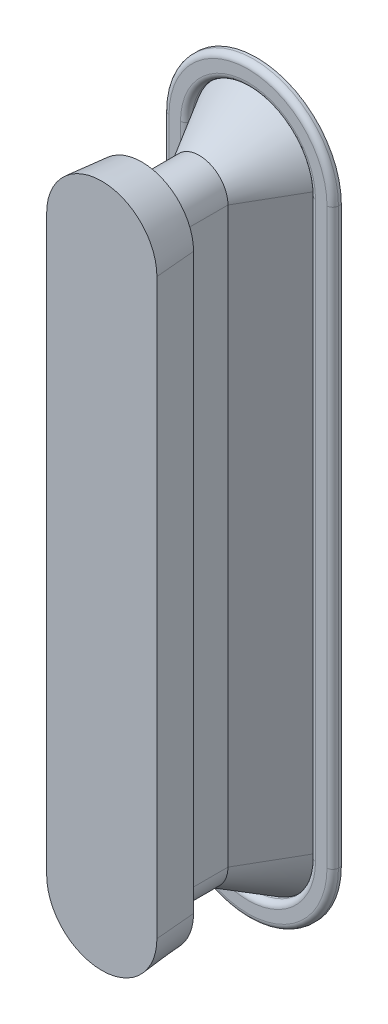
ISO-10303-21;
HEADER;
FILE_DESCRIPTION(('STEP AP214'),'2;1');
FILE_NAME('part.step','',(''),(''),'','','');
FILE_SCHEMA(('AUTOMOTIVE_DESIGN { 1 0 10303 214 1 1 1 1 }'));
ENDSEC;
DATA;
#1=APPLICATION_CONTEXT('core data for automotive mechanical design processes');
#2=APPLICATION_PROTOCOL_DEFINITION('international standard','automotive_design',2000,#1);
#3=PRODUCT_CONTEXT('',#1,'mechanical');
#4=PRODUCT('Part','Part','',(#3));
#5=PRODUCT_RELATED_PRODUCT_CATEGORY('part','',(#4));
#6=PRODUCT_DEFINITION_FORMATION('','',#4);
#7=PRODUCT_DEFINITION_CONTEXT('part definition',#1,'design');
#8=PRODUCT_DEFINITION('design','',#6,#7);
#9=PRODUCT_DEFINITION_SHAPE('','',#8);
#10=(LENGTH_UNIT() NAMED_UNIT(*) SI_UNIT(.MILLI.,.METRE.));
#11=(NAMED_UNIT(*) PLANE_ANGLE_UNIT() SI_UNIT($,.RADIAN.));
#12=(NAMED_UNIT(*) SI_UNIT($,.STERADIAN.) SOLID_ANGLE_UNIT());
#13=UNCERTAINTY_MEASURE_WITH_UNIT(LENGTH_MEASURE(1.E-05),#10,'distance_accuracy_value','');
#14=(GEOMETRIC_REPRESENTATION_CONTEXT(3) GLOBAL_UNCERTAINTY_ASSIGNED_CONTEXT((#13)) GLOBAL_UNIT_ASSIGNED_CONTEXT((#10,
#11,#12)) REPRESENTATION_CONTEXT('',''));
#15=CARTESIAN_POINT('',(0.,0.,0.));
#16=DIRECTION('',(0.,0.,1.));
#17=DIRECTION('',(1.,0.,0.));
#18=AXIS2_PLACEMENT_3D('',#15,#16,#17);
#19=CARTESIAN_POINT('',(0.,100.,-17.));
#20=DIRECTION('',(0.,0.,-1.));
#21=DIRECTION('',(-1.,0.,0.));
#22=AXIS2_PLACEMENT_3D('',#19,#20,#21);
#23=CYLINDRICAL_SURFACE('',#22,29.5470053837925);
#24=DIRECTION('',(0.,0.,-1.));
#25=VECTOR('',#24,1.);
#26=CARTESIAN_POINT('',(-29.5470053837925,100.,-17.));
#27=LINE('',#26,#25);
#28=CARTESIAN_POINT('',(-29.5470053837925,100.,-19.));
#29=VERTEX_POINT('',#28);
#30=CARTESIAN_POINT('',(-29.5470053837925,100.,-20.));
#31=VERTEX_POINT('',#30);
#32=EDGE_CURVE('E179',#29,#31,#27,.T.);
#33=ORIENTED_EDGE('',*,*,#32,.F.);
#34=CARTESIAN_POINT('',(0.,100.,-19.));
#35=DIRECTION('',(0.,0.,-1.));
#36=DIRECTION('',(-1.,0.,0.));
#37=AXIS2_PLACEMENT_3D('',#34,#35,#36);
#38=CIRCLE('',#37,29.5470053837925);
#39=CARTESIAN_POINT('',(29.5470053837925,100.,-19.));
#40=VERTEX_POINT('',#39);
#41=EDGE_CURVE('E181',#29,#40,#38,.T.);
#42=ORIENTED_EDGE('',*,*,#41,.T.);
#43=DIRECTION('',(0.,0.,-1.));
#44=VECTOR('',#43,1.);
#45=CARTESIAN_POINT('',(29.5470053837925,100.,-17.));
#46=LINE('',#45,#44);
#47=CARTESIAN_POINT('',(29.5470053837925,100.,-20.));
#48=VERTEX_POINT('',#47);
#49=EDGE_CURVE('E178',#40,#48,#46,.T.);
#50=ORIENTED_EDGE('',*,*,#49,.T.);
#51=CARTESIAN_POINT('',(0.,100.,-20.));
#52=DIRECTION('',(0.,0.,-1.));
#53=DIRECTION('',(-1.,0.,0.));
#54=AXIS2_PLACEMENT_3D('',#51,#52,#53);
#55=CIRCLE('',#54,29.5470053837925);
#56=EDGE_CURVE('E164',#31,#48,#55,.T.);
#57=ORIENTED_EDGE('',*,*,#56,.F.);
#58=EDGE_LOOP('',(#33,#42,#50,#57));
#59=FACE_BOUND('',#58,.T.);
#60=ADVANCED_FACE('F43',(#59),#23,.T.);
#61=CARTESIAN_POINT('',(-29.5470053837925,-100.,-17.));
#62=DIRECTION('',(-1.,0.,0.));
#63=DIRECTION('',(0.,-1.,0.));
#64=AXIS2_PLACEMENT_3D('',#61,#62,#63);
#65=PLANE('',#64);
#66=DIRECTION('',(0.,0.,-1.));
#67=VECTOR('',#66,1.);
#68=CARTESIAN_POINT('',(-29.5470053837925,-100.,-17.));
#69=LINE('',#68,#67);
#70=CARTESIAN_POINT('',(-29.5470053837925,-100.,-19.));
#71=VERTEX_POINT('',#70);
#72=CARTESIAN_POINT('',(-29.5470053837925,-100.,-20.));
#73=VERTEX_POINT('',#72);
#74=EDGE_CURVE('E182',#71,#73,#69,.T.);
#75=ORIENTED_EDGE('',*,*,#74,.F.);
#76=DIRECTION('',(0.,1.,0.));
#77=VECTOR('',#76,1.);
#78=CARTESIAN_POINT('',(-29.5470053837925,100.,-19.));
#79=LINE('',#78,#77);
#80=EDGE_CURVE('E207',#71,#29,#79,.T.);
#81=ORIENTED_EDGE('',*,*,#80,.T.);
#82=ORIENTED_EDGE('',*,*,#32,.T.);
#83=DIRECTION('',(0.,1.,0.));
#84=VECTOR('',#83,1.);
#85=CARTESIAN_POINT('',(-29.5470053837925,-100.,-20.));
#86=LINE('',#85,#84);
#87=EDGE_CURVE('E175',#73,#31,#86,.T.);
#88=ORIENTED_EDGE('',*,*,#87,.F.);
#89=EDGE_LOOP('',(#75,#81,#82,#88));
#90=FACE_BOUND('',#89,.T.);
#91=ADVANCED_FACE('F266',(#90),#65,.T.);
#92=CARTESIAN_POINT('',(0.,-100.,-17.));
#93=DIRECTION('',(0.,0.,-1.));
#94=DIRECTION('',(-1.,0.,0.));
#95=AXIS2_PLACEMENT_3D('',#92,#93,#94);
#96=CYLINDRICAL_SURFACE('',#95,29.5470053837925);
#97=DIRECTION('',(0.,0.,-1.));
#98=VECTOR('',#97,1.);
#99=CARTESIAN_POINT('',(29.5470053837925,-100.,-17.));
#100=LINE('',#99,#98);
#101=CARTESIAN_POINT('',(29.5470053837925,-100.,-19.));
#102=VERTEX_POINT('',#101);
#103=CARTESIAN_POINT('',(29.5470053837925,-100.,-20.));
#104=VERTEX_POINT('',#103);
#105=EDGE_CURVE('E184',#102,#104,#100,.T.);
#106=ORIENTED_EDGE('',*,*,#105,.F.);
#107=CARTESIAN_POINT('',(0.,-100.,-19.));
#108=DIRECTION('',(0.,0.,-1.));
#109=DIRECTION('',(-1.,0.,0.));
#110=AXIS2_PLACEMENT_3D('',#107,#108,#109);
#111=CIRCLE('',#110,29.5470053837925);
#112=EDGE_CURVE('E209',#102,#71,#111,.T.);
#113=ORIENTED_EDGE('',*,*,#112,.T.);
#114=ORIENTED_EDGE('',*,*,#74,.T.);
#115=CARTESIAN_POINT('',(0.,-100.,-20.));
#116=DIRECTION('',(0.,0.,-1.));
#117=DIRECTION('',(-1.,0.,0.));
#118=AXIS2_PLACEMENT_3D('',#115,#116,#117);
#119=CIRCLE('',#118,29.5470053837925);
#120=EDGE_CURVE('E172',#104,#73,#119,.T.);
#121=ORIENTED_EDGE('',*,*,#120,.F.);
#122=EDGE_LOOP('',(#106,#113,#114,#121));
#123=FACE_BOUND('',#122,.T.);
#124=ADVANCED_FACE('F261',(#123),#96,.T.);
#125=CARTESIAN_POINT('',(29.5470053837925,100.,-17.));
#126=DIRECTION('',(1.,0.,0.));
#127=DIRECTION('',(0.,0.,-1.));
#128=AXIS2_PLACEMENT_3D('',#125,#126,#127);
#129=PLANE('',#128);
#130=ORIENTED_EDGE('',*,*,#49,.F.);
#131=DIRECTION('',(0.,-1.,0.));
#132=VECTOR('',#131,1.);
#133=CARTESIAN_POINT('',(29.5470053837925,-100.,-19.));
#134=LINE('',#133,#132);
#135=EDGE_CURVE('E52',#40,#102,#134,.T.);
#136=ORIENTED_EDGE('',*,*,#135,.T.);
#137=ORIENTED_EDGE('',*,*,#105,.T.);
#138=DIRECTION('',(0.,-1.,0.));
#139=VECTOR('',#138,1.);
#140=CARTESIAN_POINT('',(29.5470053837925,100.,-20.));
#141=LINE('',#140,#139);
#142=EDGE_CURVE('E169',#48,#104,#141,.T.);
#143=ORIENTED_EDGE('',*,*,#142,.F.);
#144=EDGE_LOOP('',(#130,#136,#137,#143));
#145=FACE_BOUND('',#144,.T.);
#146=ADVANCED_FACE('F252',(#145),#129,.T.);
#147=CARTESIAN_POINT('',(0.,100.,-17.));
#148=DIRECTION('',(0.,0.,-1.));
#149=DIRECTION('',(-1.,0.,0.));
#150=AXIS2_PLACEMENT_3D('',#147,#148,#149);
#151=PLANE('',#150);
#152=DIRECTION('',(0.,-1.,0.));
#153=VECTOR('',#152,1.);
#154=CARTESIAN_POINT('',(27.5470053837925,100.,-17.));
#155=LINE('',#154,#153);
#156=CARTESIAN_POINT('',(27.5470053837925,-100.,-17.));
#157=VERTEX_POINT('',#156);
#158=CARTESIAN_POINT('',(27.5470053837925,100.,-17.));
#159=VERTEX_POINT('',#158);
#160=EDGE_CURVE('E198',#157,#159,#155,.F.);
#161=ORIENTED_EDGE('',*,*,#160,.T.);
#162=CARTESIAN_POINT('',(0.,100.,-17.));
#163=DIRECTION('',(0.,0.,-1.));
#164=DIRECTION('',(-1.,0.,0.));
#165=AXIS2_PLACEMENT_3D('',#162,#163,#164);
#166=CIRCLE('',#165,27.5470053837925);
#167=CARTESIAN_POINT('',(-27.5470053837925,100.,-17.));
#168=VERTEX_POINT('',#167);
#169=EDGE_CURVE('E204',#159,#168,#166,.F.);
#170=ORIENTED_EDGE('',*,*,#169,.T.);
#171=DIRECTION('',(0.,1.,0.));
#172=VECTOR('',#171,1.);
#173=CARTESIAN_POINT('',(-27.5470053837925,-100.,-17.));
#174=LINE('',#173,#172);
#175=CARTESIAN_POINT('',(-27.5470053837925,-100.,-17.));
#176=VERTEX_POINT('',#175);
#177=EDGE_CURVE('E202',#168,#176,#174,.F.);
#178=ORIENTED_EDGE('',*,*,#177,.T.);
#179=CARTESIAN_POINT('',(0.,-100.,-17.));
#180=DIRECTION('',(0.,0.,-1.));
#181=DIRECTION('',(-1.,0.,0.));
#182=AXIS2_PLACEMENT_3D('',#179,#180,#181);
#183=CIRCLE('',#182,27.5470053837925);
#184=EDGE_CURVE('E200',#176,#157,#183,.F.);
#185=ORIENTED_EDGE('',*,*,#184,.T.);
#186=EDGE_LOOP('',(#161,#170,#178,#185));
#187=FACE_BOUND('',#186,.T.);
#188=DIRECTION('',(0.,1.,0.));
#189=VECTOR('',#188,1.);
#190=CARTESIAN_POINT('',(-23.5470053837926,100.,-17.));
#191=LINE('',#190,#189);
#192=CARTESIAN_POINT('',(-23.5470053837925,-100.,-17.));
#193=VERTEX_POINT('',#192);
#194=CARTESIAN_POINT('',(-23.5470053837926,100.,-17.));
#195=VERTEX_POINT('',#194);
#196=EDGE_CURVE('E193',#193,#195,#191,.T.);
#197=ORIENTED_EDGE('',*,*,#196,.T.);
#198=CARTESIAN_POINT('',(0.,100.,-17.));
#199=DIRECTION('',(0.,0.,-1.));
#200=DIRECTION('',(-1.,0.,0.));
#201=AXIS2_PLACEMENT_3D('',#198,#199,#200);
#202=CIRCLE('',#201,23.5470053837926);
#203=CARTESIAN_POINT('',(23.5470053837925,100.,-17.));
#204=VERTEX_POINT('',#203);
#205=EDGE_CURVE('E195',#195,#204,#202,.T.);
#206=ORIENTED_EDGE('',*,*,#205,.T.);
#207=DIRECTION('',(0.,-1.,0.));
#208=VECTOR('',#207,1.);
#209=CARTESIAN_POINT('',(23.5470053837925,100.,-17.));
#210=LINE('',#209,#208);
#211=CARTESIAN_POINT('',(23.5470053837925,-100.,-17.));
#212=VERTEX_POINT('',#211);
#213=EDGE_CURVE('E189',#204,#212,#210,.T.);
#214=ORIENTED_EDGE('',*,*,#213,.T.);
#215=CARTESIAN_POINT('',(0.,-100.,-17.));
#216=DIRECTION('',(0.,0.,-1.));
#217=DIRECTION('',(-1.,0.,0.));
#218=AXIS2_PLACEMENT_3D('',#215,#216,#217);
#219=CIRCLE('',#218,23.5470053837925);
#220=EDGE_CURVE('E191',#212,#193,#219,.T.);
#221=ORIENTED_EDGE('',*,*,#220,.T.);
#222=EDGE_LOOP('',(#197,#206,#214,#221));
#223=FACE_BOUND('',#222,.T.);
#224=ADVANCED_FACE('F250',(#187,#223),#151,.F.);
#225=CARTESIAN_POINT('',(0.,100.,-20.));
#226=DIRECTION('',(0.,0.,-1.));
#227=DIRECTION('',(-1.,0.,0.));
#228=AXIS2_PLACEMENT_3D('',#225,#226,#227);
#229=PLANE('',#228);
#230=CARTESIAN_POINT('',(0.,-100.,-20.));
#231=DIRECTION('',(0.,0.,-1.));
#232=DIRECTION('',(-1.,0.,0.));
#233=AXIS2_PLACEMENT_3D('',#230,#231,#232);
#234=CIRCLE('',#233,21.5470053837925);
#235=CARTESIAN_POINT('',(21.5470053837925,-100.,-20.));
#236=VERTEX_POINT('',#235);
#237=CARTESIAN_POINT('',(-21.5470053837925,-100.,-20.));
#238=VERTEX_POINT('',#237);
#239=EDGE_CURVE('E152',#236,#238,#234,.T.);
#240=ORIENTED_EDGE('',*,*,#239,.F.);
#241=DIRECTION('',(0.,-1.,0.));
#242=VECTOR('',#241,1.);
#243=CARTESIAN_POINT('',(21.5470053837925,100.,-20.));
#244=LINE('',#243,#242);
#245=CARTESIAN_POINT('',(21.5470053837925,100.,-20.));
#246=VERTEX_POINT('',#245);
#247=EDGE_CURVE('E157',#246,#236,#244,.T.);
#248=ORIENTED_EDGE('',*,*,#247,.F.);
#249=CARTESIAN_POINT('',(0.,100.,-20.));
#250=DIRECTION('',(0.,0.,-1.));
#251=DIRECTION('',(-1.,0.,0.));
#252=AXIS2_PLACEMENT_3D('',#249,#250,#251);
#253=CIRCLE('',#252,21.5470053837926);
#254=CARTESIAN_POINT('',(-21.5470053837926,100.,-20.));
#255=VERTEX_POINT('',#254);
#256=EDGE_CURVE('E139',#255,#246,#253,.T.);
#257=ORIENTED_EDGE('',*,*,#256,.F.);
#258=DIRECTION('',(0.,1.,0.));
#259=VECTOR('',#258,1.);
#260=CARTESIAN_POINT('',(-21.5470053837925,-100.,-20.));
#261=LINE('',#260,#259);
#262=EDGE_CURVE('E147',#238,#255,#261,.T.);
#263=ORIENTED_EDGE('',*,*,#262,.F.);
#264=EDGE_LOOP('',(#240,#248,#257,#263));
#265=FACE_BOUND('',#264,.T.);
#266=ORIENTED_EDGE('',*,*,#56,.T.);
#267=ORIENTED_EDGE('',*,*,#142,.T.);
#268=ORIENTED_EDGE('',*,*,#120,.T.);
#269=ORIENTED_EDGE('',*,*,#87,.T.);
#270=EDGE_LOOP('',(#266,#267,#268,#269));
#271=FACE_BOUND('',#270,.T.);
#272=ADVANCED_FACE('F154',(#265,#271),#229,.T.);
#273=CARTESIAN_POINT('',(0.,-100.,-17.));
#274=DIRECTION('',(0.,0.,-1.));
#275=DIRECTION('',(-1.,0.,0.));
#276=AXIS2_PLACEMENT_3D('',#273,#274,#275);
#277=CYLINDRICAL_SURFACE('',#276,21.5470053837925);
#278=DIRECTION('',(0.,0.,-1.));
#279=VECTOR('',#278,1.);
#280=CARTESIAN_POINT('',(-21.5470053837925,-100.,-17.));
#281=LINE('',#280,#279);
#282=CARTESIAN_POINT('',(-21.5470053837925,-100.,-19.));
#283=VERTEX_POINT('',#282);
#284=EDGE_CURVE('E144',#283,#238,#281,.T.);
#285=ORIENTED_EDGE('',*,*,#284,.F.);
#286=CARTESIAN_POINT('',(0.,-100.,-19.));
#287=DIRECTION('',(0.,0.,-1.));
#288=DIRECTION('',(-1.,0.,0.));
#289=AXIS2_PLACEMENT_3D('',#286,#287,#288);
#290=CIRCLE('',#289,21.5470053837925);
#291=CARTESIAN_POINT('',(21.5470053837925,-100.,-19.));
#292=VERTEX_POINT('',#291);
#293=EDGE_CURVE('E60',#283,#292,#290,.F.);
#294=ORIENTED_EDGE('',*,*,#293,.T.);
#295=DIRECTION('',(0.,0.,-1.));
#296=VECTOR('',#295,1.);
#297=CARTESIAN_POINT('',(21.5470053837925,-100.,-17.));
#298=LINE('',#297,#296);
#299=EDGE_CURVE('E162',#292,#236,#298,.T.);
#300=ORIENTED_EDGE('',*,*,#299,.T.);
#301=ORIENTED_EDGE('',*,*,#239,.T.);
#302=EDGE_LOOP('',(#285,#294,#300,#301));
#303=FACE_BOUND('',#302,.T.);
#304=ADVANCED_FACE('F259',(#303),#277,.F.);
#305=CARTESIAN_POINT('',(21.5470053837925,100.,-17.));
#306=DIRECTION('',(1.,0.,0.));
#307=DIRECTION('',(0.,0.,-1.));
#308=AXIS2_PLACEMENT_3D('',#305,#306,#307);
#309=PLANE('',#308);
#310=ORIENTED_EDGE('',*,*,#299,.F.);
#311=DIRECTION('',(0.,-1.,0.));
#312=VECTOR('',#311,1.);
#313=CARTESIAN_POINT('',(21.5470053837925,100.,-19.));
#314=LINE('',#313,#312);
#315=CARTESIAN_POINT('',(21.5470053837925,100.,-19.));
#316=VERTEX_POINT('',#315);
#317=EDGE_CURVE('E12',#292,#316,#314,.F.);
#318=ORIENTED_EDGE('',*,*,#317,.T.);
#319=DIRECTION('',(0.,0.,-1.));
#320=VECTOR('',#319,1.);
#321=CARTESIAN_POINT('',(21.5470053837925,100.,-17.));
#322=LINE('',#321,#320);
#323=EDGE_CURVE('E143',#316,#246,#322,.T.);
#324=ORIENTED_EDGE('',*,*,#323,.T.);
#325=ORIENTED_EDGE('',*,*,#247,.T.);
#326=EDGE_LOOP('',(#310,#318,#324,#325));
#327=FACE_BOUND('',#326,.T.);
#328=ADVANCED_FACE('F245',(#327),#309,.F.);
#329=CARTESIAN_POINT('',(0.,100.,-17.));
#330=DIRECTION('',(0.,0.,-1.));
#331=DIRECTION('',(-1.,0.,0.));
#332=AXIS2_PLACEMENT_3D('',#329,#330,#331);
#333=CYLINDRICAL_SURFACE('',#332,21.5470053837926);
#334=ORIENTED_EDGE('',*,*,#323,.F.);
#335=CARTESIAN_POINT('',(0.,100.,-19.));
#336=DIRECTION('',(0.,0.,-1.));
#337=DIRECTION('',(-1.,0.,0.));
#338=AXIS2_PLACEMENT_3D('',#335,#336,#337);
#339=CIRCLE('',#338,21.5470053837926);
#340=CARTESIAN_POINT('',(-21.5470053837926,100.,-19.));
#341=VERTEX_POINT('',#340);
#342=EDGE_CURVE('E142',#316,#341,#339,.F.);
#343=ORIENTED_EDGE('',*,*,#342,.T.);
#344=DIRECTION('',(0.,0.,-1.));
#345=VECTOR('',#344,1.);
#346=CARTESIAN_POINT('',(-21.5470053837926,100.,-17.));
#347=LINE('',#346,#345);
#348=EDGE_CURVE('E134',#341,#255,#347,.T.);
#349=ORIENTED_EDGE('',*,*,#348,.T.);
#350=ORIENTED_EDGE('',*,*,#256,.T.);
#351=EDGE_LOOP('',(#334,#343,#349,#350));
#352=FACE_BOUND('',#351,.T.);
#353=ADVANCED_FACE('F137',(#352),#333,.F.);
#354=CARTESIAN_POINT('',(-21.5470053837925,-100.,-17.));
#355=DIRECTION('',(-1.,0.,0.));
#356=DIRECTION('',(0.,-1.,0.));
#357=AXIS2_PLACEMENT_3D('',#354,#355,#356);
#358=PLANE('',#357);
#359=ORIENTED_EDGE('',*,*,#348,.F.);
#360=DIRECTION('',(0.,1.,0.));
#361=VECTOR('',#360,1.);
#362=CARTESIAN_POINT('',(-21.5470053837925,-100.,-19.));
#363=LINE('',#362,#361);
#364=EDGE_CURVE('E68',#341,#283,#363,.F.);
#365=ORIENTED_EDGE('',*,*,#364,.T.);
#366=ORIENTED_EDGE('',*,*,#284,.T.);
#367=ORIENTED_EDGE('',*,*,#262,.T.);
#368=EDGE_LOOP('',(#359,#365,#366,#367));
#369=FACE_BOUND('',#368,.T.);
#370=ADVANCED_FACE('F148',(#369),#358,.F.);
#371=CARTESIAN_POINT('',(0.,-100.,-19.));
#372=DIRECTION('',(0.,0.,-1.));
#373=DIRECTION('',(-1.,0.,0.));
#374=AXIS2_PLACEMENT_3D('',#371,#372,#373);
#375=TOROIDAL_SURFACE('',#374,27.5470053837925,2.);
#376=CARTESIAN_POINT('',(27.5470053837925,-100.,-19.));
#377=DIRECTION('',(0.,1.,0.));
#378=DIRECTION('',(0.,0.,1.));
#379=AXIS2_PLACEMENT_3D('',#376,#377,#378);
#380=CIRCLE('',#379,2.);
#381=EDGE_CURVE('E219',#157,#102,#380,.T.);
#382=ORIENTED_EDGE('',*,*,#381,.F.);
#383=ORIENTED_EDGE('',*,*,#184,.F.);
#384=CARTESIAN_POINT('',(-27.5470053837925,-100.,-19.));
#385=DIRECTION('',(0.,1.,0.));
#386=DIRECTION('',(0.,0.,1.));
#387=AXIS2_PLACEMENT_3D('',#384,#385,#386);
#388=CIRCLE('',#387,2.);
#389=EDGE_CURVE('E222',#71,#176,#388,.T.);
#390=ORIENTED_EDGE('',*,*,#389,.F.);
#391=ORIENTED_EDGE('',*,*,#112,.F.);
#392=EDGE_LOOP('',(#382,#383,#390,#391));
#393=FACE_BOUND('',#392,.T.);
#394=ADVANCED_FACE('F288',(#393),#375,.T.);
#395=CARTESIAN_POINT('',(-27.5470053837925,-100.,-19.));
#396=DIRECTION('',(0.,-1.,0.));
#397=DIRECTION('',(1.,0.,0.));
#398=AXIS2_PLACEMENT_3D('',#395,#396,#397);
#399=CYLINDRICAL_SURFACE('',#398,2.);
#400=ORIENTED_EDGE('',*,*,#389,.T.);
#401=ORIENTED_EDGE('',*,*,#177,.F.);
#402=CARTESIAN_POINT('',(-27.5470053837925,100.,-19.));
#403=DIRECTION('',(0.,1.,0.));
#404=DIRECTION('',(0.,0.,1.));
#405=AXIS2_PLACEMENT_3D('',#402,#403,#404);
#406=CIRCLE('',#405,2.);
#407=EDGE_CURVE('E217',#29,#168,#406,.T.);
#408=ORIENTED_EDGE('',*,*,#407,.F.);
#409=ORIENTED_EDGE('',*,*,#80,.F.);
#410=EDGE_LOOP('',(#400,#401,#408,#409));
#411=FACE_BOUND('',#410,.T.);
#412=ADVANCED_FACE('F284',(#411),#399,.T.);
#413=CARTESIAN_POINT('',(27.5470053837925,100.,-19.));
#414=DIRECTION('',(0.,1.,0.));
#415=DIRECTION('',(0.,0.,1.));
#416=AXIS2_PLACEMENT_3D('',#413,#414,#415);
#417=CYLINDRICAL_SURFACE('',#416,2.);
#418=ORIENTED_EDGE('',*,*,#381,.T.);
#419=ORIENTED_EDGE('',*,*,#135,.F.);
#420=CARTESIAN_POINT('',(27.5470053837925,100.,-19.));
#421=DIRECTION('',(0.,1.,0.));
#422=DIRECTION('',(0.,0.,1.));
#423=AXIS2_PLACEMENT_3D('',#420,#421,#422);
#424=CIRCLE('',#423,2.);
#425=EDGE_CURVE('E215',#159,#40,#424,.T.);
#426=ORIENTED_EDGE('',*,*,#425,.F.);
#427=ORIENTED_EDGE('',*,*,#160,.F.);
#428=EDGE_LOOP('',(#418,#419,#426,#427));
#429=FACE_BOUND('',#428,.T.);
#430=ADVANCED_FACE('F280',(#429),#417,.T.);
#431=CARTESIAN_POINT('',(0.,100.,-19.));
#432=DIRECTION('',(0.,0.,-1.));
#433=DIRECTION('',(-1.,0.,0.));
#434=AXIS2_PLACEMENT_3D('',#431,#432,#433);
#435=TOROIDAL_SURFACE('',#434,27.5470053837925,2.);
#436=ORIENTED_EDGE('',*,*,#407,.T.);
#437=ORIENTED_EDGE('',*,*,#169,.F.);
#438=ORIENTED_EDGE('',*,*,#425,.T.);
#439=ORIENTED_EDGE('',*,*,#41,.F.);
#440=EDGE_LOOP('',(#436,#437,#438,#439));
#441=FACE_BOUND('',#440,.T.);
#442=ADVANCED_FACE('F277',(#441),#435,.T.);
#443=CARTESIAN_POINT('',(0.,-100.,-19.));
#444=DIRECTION('',(0.,0.,-1.));
#445=DIRECTION('',(-1.,0.,0.));
#446=AXIS2_PLACEMENT_3D('',#443,#444,#445);
#447=TOROIDAL_SURFACE('',#446,23.5470053837925,2.);
#448=CARTESIAN_POINT('',(23.5470053837925,-100.,-19.));
#449=DIRECTION('',(0.,1.,0.));
#450=DIRECTION('',(0.,0.,1.));
#451=AXIS2_PLACEMENT_3D('',#448,#449,#450);
#452=CIRCLE('',#451,2.);
#453=EDGE_CURVE('E228',#292,#212,#452,.T.);
#454=ORIENTED_EDGE('',*,*,#453,.F.);
#455=ORIENTED_EDGE('',*,*,#293,.F.);
#456=CARTESIAN_POINT('',(-23.5470053837925,-100.,-19.));
#457=DIRECTION('',(0.,1.,0.));
#458=DIRECTION('',(0.,0.,1.));
#459=AXIS2_PLACEMENT_3D('',#456,#457,#458);
#460=CIRCLE('',#459,2.);
#461=EDGE_CURVE('E47',#193,#283,#460,.T.);
#462=ORIENTED_EDGE('',*,*,#461,.F.);
#463=ORIENTED_EDGE('',*,*,#220,.F.);
#464=EDGE_LOOP('',(#454,#455,#462,#463));
#465=FACE_BOUND('',#464,.T.);
#466=ADVANCED_FACE('F45',(#465),#447,.T.);
#467=CARTESIAN_POINT('',(-23.5470053837926,100.,-19.));
#468=DIRECTION('',(0.,1.,0.));
#469=DIRECTION('',(-1.,0.,0.));
#470=AXIS2_PLACEMENT_3D('',#467,#468,#469);
#471=CYLINDRICAL_SURFACE('',#470,2.);
#472=ORIENTED_EDGE('',*,*,#461,.T.);
#473=ORIENTED_EDGE('',*,*,#364,.F.);
#474=CARTESIAN_POINT('',(-23.5470053837926,100.,-19.));
#475=DIRECTION('',(0.,1.,0.));
#476=DIRECTION('',(0.,0.,1.));
#477=AXIS2_PLACEMENT_3D('',#474,#475,#476);
#478=CIRCLE('',#477,2.);
#479=EDGE_CURVE('E227',#195,#341,#478,.T.);
#480=ORIENTED_EDGE('',*,*,#479,.F.);
#481=ORIENTED_EDGE('',*,*,#196,.F.);
#482=EDGE_LOOP('',(#472,#473,#480,#481));
#483=FACE_BOUND('',#482,.T.);
#484=ADVANCED_FACE('F238',(#483),#471,.T.);
#485=CARTESIAN_POINT('',(23.5470053837925,100.,-19.));
#486=DIRECTION('',(0.,-1.,0.));
#487=DIRECTION('',(0.,0.,-1.));
#488=AXIS2_PLACEMENT_3D('',#485,#486,#487);
#489=CYLINDRICAL_SURFACE('',#488,2.);
#490=ORIENTED_EDGE('',*,*,#453,.T.);
#491=ORIENTED_EDGE('',*,*,#213,.F.);
#492=CARTESIAN_POINT('',(23.5470053837925,100.,-19.));
#493=DIRECTION('',(0.,1.,0.));
#494=DIRECTION('',(0.,0.,1.));
#495=AXIS2_PLACEMENT_3D('',#492,#493,#494);
#496=CIRCLE('',#495,2.);
#497=EDGE_CURVE('E225',#316,#204,#496,.T.);
#498=ORIENTED_EDGE('',*,*,#497,.F.);
#499=ORIENTED_EDGE('',*,*,#317,.F.);
#500=EDGE_LOOP('',(#490,#491,#498,#499));
#501=FACE_BOUND('',#500,.T.);
#502=ADVANCED_FACE('F243',(#501),#489,.T.);
#503=CARTESIAN_POINT('',(0.,100.,-19.));
#504=DIRECTION('',(0.,0.,-1.));
#505=DIRECTION('',(-1.,0.,0.));
#506=AXIS2_PLACEMENT_3D('',#503,#504,#505);
#507=TOROIDAL_SURFACE('',#506,23.5470053837926,2.);
#508=ORIENTED_EDGE('',*,*,#479,.T.);
#509=ORIENTED_EDGE('',*,*,#342,.F.);
#510=ORIENTED_EDGE('',*,*,#497,.T.);
#511=ORIENTED_EDGE('',*,*,#205,.F.);
#512=EDGE_LOOP('',(#508,#509,#510,#511));
#513=FACE_BOUND('',#512,.T.);
#514=ADVANCED_FACE('F247',(#513),#507,.T.);
#515=CLOSED_SHELL('',(#60,#91,#124,#146,#224,#272,#304,#328,#353,#370,#394,#412,#430,#442,#466,
#484,#502,#514));
#516=MANIFOLD_SOLID_BREP('B2',#515);
#517=CARTESIAN_POINT('',(0.,-100.,0.));
#518=DIRECTION('',(0.,0.,-1.));
#519=DIRECTION('',(1.,0.,0.));
#520=AXIS2_PLACEMENT_3D('',#517,#518,#519);
#521=CONICAL_SURFACE('',#520,9.99999999999999,0.5235987755983);
#522=CARTESIAN_POINT('',(0.,-100.,0.));
#523=DIRECTION('',(0.,0.,1.));
#524=DIRECTION('',(1.,0.,0.));
#525=AXIS2_PLACEMENT_3D('',#522,#523,#524);
#526=CIRCLE('',#525,9.99999999999999);
#527=CARTESIAN_POINT('',(-9.99999999999998,-100.,0.));
#528=VERTEX_POINT('',#527);
#529=CARTESIAN_POINT('',(10.,-100.,0.));
#530=VERTEX_POINT('',#529);
#531=EDGE_CURVE('E583',#528,#530,#526,.T.);
#532=ORIENTED_EDGE('',*,*,#531,.F.);
#533=DIRECTION('',(-0.500000000000001,0.,-0.866025403784438));
#534=VECTOR('',#533,1.);
#535=CARTESIAN_POINT('',(-9.99999999999998,-100.,0.));
#536=LINE('',#535,#534);
#537=CARTESIAN_POINT('',(-21.5470053837925,-100.,-20.));
#538=VERTEX_POINT('',#537);
#539=EDGE_CURVE('E41',#538,#528,#536,.F.);
#540=ORIENTED_EDGE('',*,*,#539,.F.);
#541=CARTESIAN_POINT('',(0.,-100.,-20.));
#542=DIRECTION('',(0.,0.,1.));
#543=DIRECTION('',(1.,0.,0.));
#544=AXIS2_PLACEMENT_3D('',#541,#542,#543);
#545=CIRCLE('',#544,21.5470053837925);
#546=CARTESIAN_POINT('',(21.5470053837925,-100.,-20.));
#547=VERTEX_POINT('',#546);
#548=EDGE_CURVE('E595',#538,#547,#545,.T.);
#549=ORIENTED_EDGE('',*,*,#548,.T.);
#550=DIRECTION('',(0.500000000000001,0.,-0.866025403784438));
#551=VECTOR('',#550,1.);
#552=CARTESIAN_POINT('',(9.99999999999999,-100.,0.));
#553=LINE('',#552,#551);
#554=EDGE_CURVE('E469',#547,#530,#553,.F.);
#555=ORIENTED_EDGE('',*,*,#554,.T.);
#556=EDGE_LOOP('',(#532,#540,#549,#555));
#557=FACE_BOUND('',#556,.T.);
#558=ADVANCED_FACE('F433',(#557),#521,.T.);
#559=CARTESIAN_POINT('',(-9.99999999999998,-100.,0.));
#560=DIRECTION('',(-0.866025403784438,0.,0.500000000000001));
#561=DIRECTION('',(0.500000000000001,0.,0.866025403784438));
#562=AXIS2_PLACEMENT_3D('',#559,#560,#561);
#563=PLANE('',#562);
#564=DIRECTION('',(0.,-1.,0.));
#565=VECTOR('',#564,1.);
#566=CARTESIAN_POINT('',(-9.99999999999998,-100.,0.));
#567=LINE('',#566,#565);
#568=CARTESIAN_POINT('',(-10.,100.,0.));
#569=VERTEX_POINT('',#568);
#570=EDGE_CURVE('E592',#569,#528,#567,.T.);
#571=ORIENTED_EDGE('',*,*,#570,.F.);
#572=DIRECTION('',(-0.500000000000001,0.,-0.866025403784438));
#573=VECTOR('',#572,1.);
#574=CARTESIAN_POINT('',(-10.,100.,0.));
#575=LINE('',#574,#573);
#576=CARTESIAN_POINT('',(-21.5470053837926,100.,-20.));
#577=VERTEX_POINT('',#576);
#578=EDGE_CURVE('E437',#577,#569,#575,.F.);
#579=ORIENTED_EDGE('',*,*,#578,.F.);
#580=DIRECTION('',(0.,-1.,0.));
#581=VECTOR('',#580,1.);
#582=CARTESIAN_POINT('',(-21.5470053837925,-100.,-20.));
#583=LINE('',#582,#581);
#584=EDGE_CURVE('E598',#577,#538,#583,.T.);
#585=ORIENTED_EDGE('',*,*,#584,.T.);
#586=ORIENTED_EDGE('',*,*,#539,.T.);
#587=EDGE_LOOP('',(#571,#579,#585,#586));
#588=FACE_BOUND('',#587,.T.);
#589=ADVANCED_FACE('F435',(#588),#563,.T.);
#590=CARTESIAN_POINT('',(0.,100.,0.));
#591=DIRECTION('',(0.,0.,-1.));
#592=DIRECTION('',(1.,0.,0.));
#593=AXIS2_PLACEMENT_3D('',#590,#591,#592);
#594=CONICAL_SURFACE('',#593,10.,0.5235987755983);
#595=CARTESIAN_POINT('',(0.,100.,0.));
#596=DIRECTION('',(0.,0.,1.));
#597=DIRECTION('',(1.,0.,0.));
#598=AXIS2_PLACEMENT_3D('',#595,#596,#597);
#599=CIRCLE('',#598,10.);
#600=CARTESIAN_POINT('',(9.99999999999996,100.,0.));
#601=VERTEX_POINT('',#600);
#602=EDGE_CURVE('E589',#601,#569,#599,.T.);
#603=ORIENTED_EDGE('',*,*,#602,.F.);
#604=DIRECTION('',(0.500000000000001,0.,-0.866025403784438));
#605=VECTOR('',#604,1.);
#606=CARTESIAN_POINT('',(9.99999999999999,100.,0.));
#607=LINE('',#606,#605);
#608=CARTESIAN_POINT('',(21.5470053837925,100.,-20.));
#609=VERTEX_POINT('',#608);
#610=EDGE_CURVE('E462',#609,#601,#607,.F.);
#611=ORIENTED_EDGE('',*,*,#610,.F.);
#612=CARTESIAN_POINT('',(0.,100.,-20.));
#613=DIRECTION('',(0.,0.,1.));
#614=DIRECTION('',(1.,0.,0.));
#615=AXIS2_PLACEMENT_3D('',#612,#613,#614);
#616=CIRCLE('',#615,21.5470053837925);
#617=EDGE_CURVE('E601',#609,#577,#616,.T.);
#618=ORIENTED_EDGE('',*,*,#617,.T.);
#619=ORIENTED_EDGE('',*,*,#578,.T.);
#620=EDGE_LOOP('',(#603,#611,#618,#619));
#621=FACE_BOUND('',#620,.T.);
#622=ADVANCED_FACE('F617',(#621),#594,.T.);
#623=CARTESIAN_POINT('',(10.,-100.,0.));
#624=DIRECTION('',(0.866025403784438,0.,0.500000000000001));
#625=DIRECTION('',(0.500000000000001,0.,-0.866025403784438));
#626=AXIS2_PLACEMENT_3D('',#623,#624,#625);
#627=PLANE('',#626);
#628=DIRECTION('',(0.,1.,0.));
#629=VECTOR('',#628,1.);
#630=CARTESIAN_POINT('',(10.,-100.,0.));
#631=LINE('',#630,#629);
#632=EDGE_CURVE('E586',#530,#601,#631,.T.);
#633=ORIENTED_EDGE('',*,*,#632,.F.);
#634=ORIENTED_EDGE('',*,*,#554,.F.);
#635=DIRECTION('',(0.,1.,0.));
#636=VECTOR('',#635,1.);
#637=CARTESIAN_POINT('',(21.5470053837925,-100.,-20.));
#638=LINE('',#637,#636);
#639=EDGE_CURVE('E597',#547,#609,#638,.T.);
#640=ORIENTED_EDGE('',*,*,#639,.T.);
#641=ORIENTED_EDGE('',*,*,#610,.T.);
#642=EDGE_LOOP('',(#633,#634,#640,#641));
#643=FACE_BOUND('',#642,.T.);
#644=ADVANCED_FACE('F604',(#643),#627,.T.);
#645=CARTESIAN_POINT('',(0.,-100.,-20.));
#646=DIRECTION('',(0.,0.,1.));
#647=DIRECTION('',(1.,0.,0.));
#648=AXIS2_PLACEMENT_3D('',#645,#646,#647);
#649=PLANE('',#648);
#650=ORIENTED_EDGE('',*,*,#548,.F.);
#651=ORIENTED_EDGE('',*,*,#584,.F.);
#652=ORIENTED_EDGE('',*,*,#617,.F.);
#653=ORIENTED_EDGE('',*,*,#639,.F.);
#654=EDGE_LOOP('',(#650,#651,#652,#653));
#655=FACE_BOUND('',#654,.T.);
#656=ADVANCED_FACE('F623',(#655),#649,.F.);
#657=CARTESIAN_POINT('',(0.,-100.,20.));
#658=DIRECTION('',(0.,0.,-1.));
#659=DIRECTION('',(-1.,0.,0.));
#660=AXIS2_PLACEMENT_3D('',#657,#658,#659);
#661=CYLINDRICAL_SURFACE('',#660,9.99999999999999);
#662=ORIENTED_EDGE('',*,*,#531,.T.);
#663=DIRECTION('',(0.,0.,-1.));
#664=VECTOR('',#663,1.);
#665=CARTESIAN_POINT('',(10.,-100.,20.));
#666=LINE('',#665,#664);
#667=CARTESIAN_POINT('',(10.,-100.,20.));
#668=VERTEX_POINT('',#667);
#669=EDGE_CURVE('E580',#668,#530,#666,.T.);
#670=ORIENTED_EDGE('',*,*,#669,.F.);
#671=CARTESIAN_POINT('',(0.,-100.,20.));
#672=DIRECTION('',(0.,0.,1.));
#673=DIRECTION('',(1.,0.,0.));
#674=AXIS2_PLACEMENT_3D('',#671,#672,#673);
#675=CIRCLE('',#674,9.99999999999999);
#676=CARTESIAN_POINT('',(-9.99999999999998,-100.,20.));
#677=VERTEX_POINT('',#676);
#678=EDGE_CURVE('E536',#677,#668,#675,.T.);
#679=ORIENTED_EDGE('',*,*,#678,.F.);
#680=DIRECTION('',(0.,0.,-1.));
#681=VECTOR('',#680,1.);
#682=CARTESIAN_POINT('',(-9.99999999999998,-100.,20.));
#683=LINE('',#682,#681);
#684=EDGE_CURVE('E571',#677,#528,#683,.T.);
#685=ORIENTED_EDGE('',*,*,#684,.T.);
#686=EDGE_LOOP('',(#662,#670,#679,#685));
#687=FACE_BOUND('',#686,.T.);
#688=ADVANCED_FACE('F609',(#687),#661,.T.);
#689=CARTESIAN_POINT('',(10.,-100.,20.));
#690=DIRECTION('',(-1.,0.,0.));
#691=DIRECTION('',(0.,0.,1.));
#692=AXIS2_PLACEMENT_3D('',#689,#690,#691);
#693=PLANE('',#692);
#694=ORIENTED_EDGE('',*,*,#632,.T.);
#695=DIRECTION('',(0.,0.,-1.));
#696=VECTOR('',#695,1.);
#697=CARTESIAN_POINT('',(9.99999999999996,100.,20.));
#698=LINE('',#697,#696);
#699=CARTESIAN_POINT('',(9.99999999999996,100.,20.));
#700=VERTEX_POINT('',#699);
#701=EDGE_CURVE('E577',#700,#601,#698,.T.);
#702=ORIENTED_EDGE('',*,*,#701,.F.);
#703=DIRECTION('',(0.,1.,0.));
#704=VECTOR('',#703,1.);
#705=CARTESIAN_POINT('',(10.,-100.,20.));
#706=LINE('',#705,#704);
#707=EDGE_CURVE('E562',#668,#700,#706,.T.);
#708=ORIENTED_EDGE('',*,*,#707,.F.);
#709=ORIENTED_EDGE('',*,*,#669,.T.);
#710=EDGE_LOOP('',(#694,#702,#708,#709));
#711=FACE_BOUND('',#710,.T.);
#712=ADVANCED_FACE('F607',(#711),#693,.F.);
#713=CARTESIAN_POINT('',(0.,100.,20.));
#714=DIRECTION('',(0.,0.,-1.));
#715=DIRECTION('',(-1.,0.,0.));
#716=AXIS2_PLACEMENT_3D('',#713,#714,#715);
#717=CYLINDRICAL_SURFACE('',#716,10.);
#718=ORIENTED_EDGE('',*,*,#602,.T.);
#719=DIRECTION('',(0.,0.,-1.));
#720=VECTOR('',#719,1.);
#721=CARTESIAN_POINT('',(-10.,100.,20.));
#722=LINE('',#721,#720);
#723=CARTESIAN_POINT('',(-10.,100.,20.));
#724=VERTEX_POINT('',#723);
#725=EDGE_CURVE('E574',#724,#569,#722,.T.);
#726=ORIENTED_EDGE('',*,*,#725,.F.);
#727=CARTESIAN_POINT('',(0.,100.,20.));
#728=DIRECTION('',(0.,0.,1.));
#729=DIRECTION('',(1.,0.,0.));
#730=AXIS2_PLACEMENT_3D('',#727,#728,#729);
#731=CIRCLE('',#730,10.);
#732=EDGE_CURVE('E565',#700,#724,#731,.T.);
#733=ORIENTED_EDGE('',*,*,#732,.F.);
#734=ORIENTED_EDGE('',*,*,#701,.T.);
#735=EDGE_LOOP('',(#718,#726,#733,#734));
#736=FACE_BOUND('',#735,.T.);
#737=ADVANCED_FACE('F616',(#736),#717,.T.);
#738=CARTESIAN_POINT('',(-9.99999999999998,-100.,20.));
#739=DIRECTION('',(1.,0.,0.));
#740=DIRECTION('',(0.,1.,0.));
#741=AXIS2_PLACEMENT_3D('',#738,#739,#740);
#742=PLANE('',#741);
#743=ORIENTED_EDGE('',*,*,#570,.T.);
#744=ORIENTED_EDGE('',*,*,#684,.F.);
#745=DIRECTION('',(0.,-1.,0.));
#746=VECTOR('',#745,1.);
#747=CARTESIAN_POINT('',(-9.99999999999998,-100.,20.));
#748=LINE('',#747,#746);
#749=EDGE_CURVE('E568',#724,#677,#748,.T.);
#750=ORIENTED_EDGE('',*,*,#749,.F.);
#751=ORIENTED_EDGE('',*,*,#725,.T.);
#752=EDGE_LOOP('',(#743,#744,#750,#751));
#753=FACE_BOUND('',#752,.T.);
#754=ADVANCED_FACE('F613',(#753),#742,.F.);
#755=CARTESIAN_POINT('',(0.,-100.,20.));
#756=DIRECTION('',(0.,0.,1.));
#757=DIRECTION('',(1.,0.,0.));
#758=AXIS2_PLACEMENT_3D('',#755,#756,#757);
#759=PLANE('',#758);
#760=CARTESIAN_POINT('',(0.,-100.,20.));
#761=DIRECTION('',(0.,0.,1.));
#762=DIRECTION('',(1.,0.,0.));
#763=AXIS2_PLACEMENT_3D('',#760,#761,#762);
#764=CIRCLE('',#763,18.);
#765=CARTESIAN_POINT('',(-18.,-100.,20.));
#766=VERTEX_POINT('',#765);
#767=CARTESIAN_POINT('',(18.,-100.,20.));
#768=VERTEX_POINT('',#767);
#769=EDGE_CURVE('E523',#766,#768,#764,.T.);
#770=ORIENTED_EDGE('',*,*,#769,.F.);
#771=DIRECTION('',(0.,-1.,0.));
#772=VECTOR('',#771,1.);
#773=CARTESIAN_POINT('',(-18.,100.,20.));
#774=LINE('',#773,#772);
#775=CARTESIAN_POINT('',(-18.,100.,20.));
#776=VERTEX_POINT('',#775);
#777=EDGE_CURVE('E546',#776,#766,#774,.T.);
#778=ORIENTED_EDGE('',*,*,#777,.F.);
#779=CARTESIAN_POINT('',(0.,100.,20.));
#780=DIRECTION('',(0.,0.,1.));
#781=DIRECTION('',(1.,0.,0.));
#782=AXIS2_PLACEMENT_3D('',#779,#780,#781);
#783=CIRCLE('',#782,18.);
#784=CARTESIAN_POINT('',(18.,100.,20.));
#785=VERTEX_POINT('',#784);
#786=EDGE_CURVE('E524',#785,#776,#783,.T.);
#787=ORIENTED_EDGE('',*,*,#786,.F.);
#788=DIRECTION('',(0.,1.,0.));
#789=VECTOR('',#788,1.);
#790=CARTESIAN_POINT('',(18.,-100.,20.));
#791=LINE('',#790,#789);
#792=EDGE_CURVE('E517',#768,#785,#791,.T.);
#793=ORIENTED_EDGE('',*,*,#792,.F.);
#794=EDGE_LOOP('',(#770,#778,#787,#793));
#795=FACE_BOUND('',#794,.T.);
#796=ORIENTED_EDGE('',*,*,#749,.T.);
#797=ORIENTED_EDGE('',*,*,#678,.T.);
#798=ORIENTED_EDGE('',*,*,#707,.T.);
#799=ORIENTED_EDGE('',*,*,#732,.T.);
#800=EDGE_LOOP('',(#796,#797,#798,#799));
#801=FACE_BOUND('',#800,.T.);
#802=ADVANCED_FACE('F519',(#795,#801),#759,.F.);
#803=CARTESIAN_POINT('',(0.,-100.,20.));
#804=DIRECTION('',(0.,0.,1.));
#805=DIRECTION('',(1.,0.,0.));
#806=AXIS2_PLACEMENT_3D('',#803,#804,#805);
#807=CONICAL_SURFACE('',#806,18.,0.0872664625997167);
#808=ORIENTED_EDGE('',*,*,#769,.T.);
#809=DIRECTION('',(0.0871557427476584,0.,0.996194698091745));
#810=VECTOR('',#809,1.);
#811=CARTESIAN_POINT('',(18.,-100.,20.));
#812=LINE('',#811,#810);
#813=CARTESIAN_POINT('',(19.2248412893629,-100.,34.));
#814=VERTEX_POINT('',#813);
#815=EDGE_CURVE('E530',#814,#768,#812,.F.);
#816=ORIENTED_EDGE('',*,*,#815,.F.);
#817=CARTESIAN_POINT('',(0.,-100.,34.));
#818=DIRECTION('',(0.,0.,1.));
#819=DIRECTION('',(1.,0.,0.));
#820=AXIS2_PLACEMENT_3D('',#817,#818,#819);
#821=CIRCLE('',#820,19.2248412893629);
#822=CARTESIAN_POINT('',(-19.2248412893629,-100.,34.));
#823=VERTEX_POINT('',#822);
#824=EDGE_CURVE('E548',#823,#814,#821,.T.);
#825=ORIENTED_EDGE('',*,*,#824,.F.);
#826=DIRECTION('',(-0.0871557427476584,0.,0.996194698091745));
#827=VECTOR('',#826,1.);
#828=CARTESIAN_POINT('',(-18.,-100.,20.));
#829=LINE('',#828,#827);
#830=EDGE_CURVE('E542',#823,#766,#829,.F.);
#831=ORIENTED_EDGE('',*,*,#830,.T.);
#832=EDGE_LOOP('',(#808,#816,#825,#831));
#833=FACE_BOUND('',#832,.T.);
#834=ADVANCED_FACE('F540',(#833),#807,.T.);
#835=CARTESIAN_POINT('',(18.,-100.,20.));
#836=DIRECTION('',(0.996194698091746,0.,-0.0871557427476584));
#837=DIRECTION('',(-0.0871557427476584,0.,-0.996194698091746));
#838=AXIS2_PLACEMENT_3D('',#835,#836,#837);
#839=PLANE('',#838);
#840=ORIENTED_EDGE('',*,*,#792,.T.);
#841=DIRECTION('',(0.0871557427476584,0.,0.996194698091745));
#842=VECTOR('',#841,1.);
#843=CARTESIAN_POINT('',(18.,100.,20.));
#844=LINE('',#843,#842);
#845=CARTESIAN_POINT('',(19.2248412893629,100.,34.));
#846=VERTEX_POINT('',#845);
#847=EDGE_CURVE('E537',#846,#785,#844,.F.);
#848=ORIENTED_EDGE('',*,*,#847,.F.);
#849=DIRECTION('',(0.,-1.,0.));
#850=VECTOR('',#849,1.);
#851=CARTESIAN_POINT('',(19.2248412893629,-100.,34.));
#852=LINE('',#851,#850);
#853=EDGE_CURVE('E532',#814,#846,#852,.F.);
#854=ORIENTED_EDGE('',*,*,#853,.F.);
#855=ORIENTED_EDGE('',*,*,#815,.T.);
#856=EDGE_LOOP('',(#840,#848,#854,#855));
#857=FACE_BOUND('',#856,.T.);
#858=ADVANCED_FACE('F531',(#857),#839,.T.);
#859=CARTESIAN_POINT('',(0.,100.,20.));
#860=DIRECTION('',(0.,0.,1.));
#861=DIRECTION('',(1.,0.,0.));
#862=AXIS2_PLACEMENT_3D('',#859,#860,#861);
#863=CONICAL_SURFACE('',#862,18.,0.0872664625997167);
#864=ORIENTED_EDGE('',*,*,#786,.T.);
#865=DIRECTION('',(-0.0871557427476584,0.,0.996194698091745));
#866=VECTOR('',#865,1.);
#867=CARTESIAN_POINT('',(-18.,100.,20.));
#868=LINE('',#867,#866);
#869=CARTESIAN_POINT('',(-19.224841289363,100.,34.));
#870=VERTEX_POINT('',#869);
#871=EDGE_CURVE('E556',#870,#776,#868,.F.);
#872=ORIENTED_EDGE('',*,*,#871,.F.);
#873=CARTESIAN_POINT('',(0.,100.,34.));
#874=DIRECTION('',(0.,0.,1.));
#875=DIRECTION('',(1.,0.,0.));
#876=AXIS2_PLACEMENT_3D('',#873,#874,#875);
#877=CIRCLE('',#876,19.2248412893629);
#878=EDGE_CURVE('E551',#846,#870,#877,.T.);
#879=ORIENTED_EDGE('',*,*,#878,.F.);
#880=ORIENTED_EDGE('',*,*,#847,.T.);
#881=EDGE_LOOP('',(#864,#872,#879,#880));
#882=FACE_BOUND('',#881,.T.);
#883=ADVANCED_FACE('F644',(#882),#863,.T.);
#884=CARTESIAN_POINT('',(-18.,100.,20.));
#885=DIRECTION('',(-0.996194698091746,0.,-0.0871557427476584));
#886=DIRECTION('',(-0.0871557427476584,0.,0.996194698091746));
#887=AXIS2_PLACEMENT_3D('',#884,#885,#886);
#888=PLANE('',#887);
#889=ORIENTED_EDGE('',*,*,#777,.T.);
#890=ORIENTED_EDGE('',*,*,#830,.F.);
#891=DIRECTION('',(0.,1.,0.));
#892=VECTOR('',#891,1.);
#893=CARTESIAN_POINT('',(-19.224841289363,100.,34.));
#894=LINE('',#893,#892);
#895=EDGE_CURVE('E553',#870,#823,#894,.F.);
#896=ORIENTED_EDGE('',*,*,#895,.F.);
#897=ORIENTED_EDGE('',*,*,#871,.T.);
#898=EDGE_LOOP('',(#889,#890,#896,#897));
#899=FACE_BOUND('',#898,.T.);
#900=ADVANCED_FACE('F647',(#899),#888,.T.);
#901=CARTESIAN_POINT('',(0.,-100.,34.));
#902=DIRECTION('',(0.,0.,1.));
#903=DIRECTION('',(1.,0.,0.));
#904=AXIS2_PLACEMENT_3D('',#901,#902,#903);
#905=PLANE('',#904);
#906=ORIENTED_EDGE('',*,*,#824,.T.);
#907=ORIENTED_EDGE('',*,*,#853,.T.);
#908=ORIENTED_EDGE('',*,*,#878,.T.);
#909=ORIENTED_EDGE('',*,*,#895,.T.);
#910=EDGE_LOOP('',(#906,#907,#908,#909));
#911=FACE_BOUND('',#910,.T.);
#912=ADVANCED_FACE('F651',(#911),#905,.T.);
#913=CLOSED_SHELL('',(#558,#589,#622,#644,#656,#688,#712,#737,#754,#802,#834,#858,#883,#900,#912));
#914=MANIFOLD_SOLID_BREP('B6',#913);
#915=ADVANCED_BREP_SHAPE_REPRESENTATION('',(#18,#516,#914),#14);
#916=SHAPE_DEFINITION_REPRESENTATION(#9,#915);
ENDSEC;
END-ISO-10303-21;
